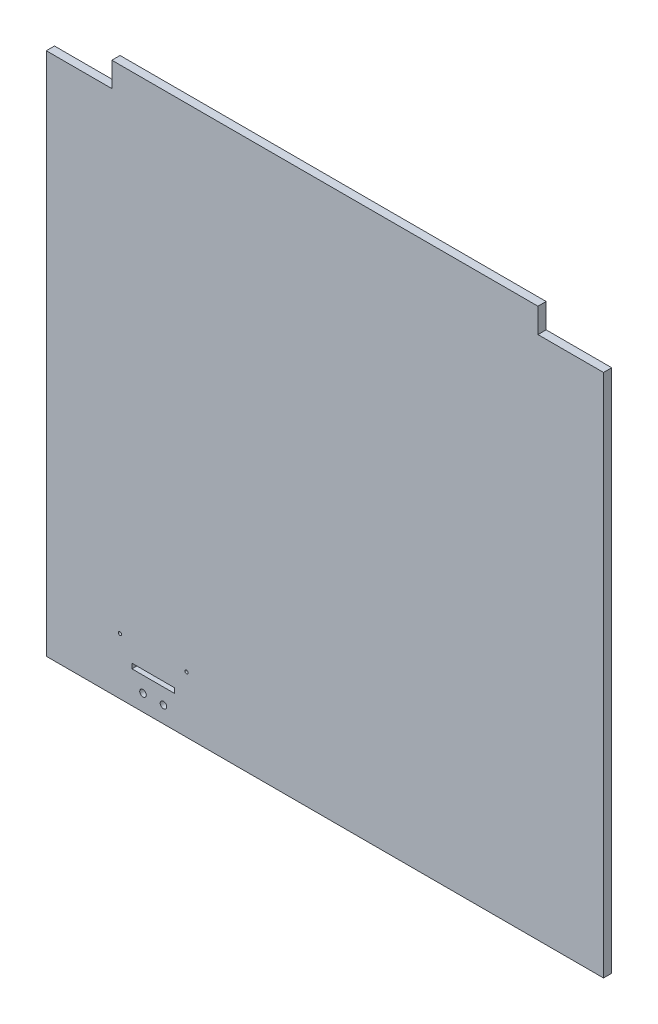
ISO-10303-21;
HEADER;
FILE_DESCRIPTION(('STEP AP214'),'2;1');
FILE_NAME('part.step','',(''),(''),'','','');
FILE_SCHEMA(('AUTOMOTIVE_DESIGN { 1 0 10303 214 1 1 1 1 }'));
ENDSEC;
DATA;
#1=APPLICATION_CONTEXT('core data for automotive mechanical design processes');
#2=APPLICATION_PROTOCOL_DEFINITION('international standard','automotive_design',2000,#1);
#3=PRODUCT_CONTEXT('',#1,'mechanical');
#4=PRODUCT('Part','Part','',(#3));
#5=PRODUCT_RELATED_PRODUCT_CATEGORY('part','',(#4));
#6=PRODUCT_DEFINITION_FORMATION('','',#4);
#7=PRODUCT_DEFINITION_CONTEXT('part definition',#1,'design');
#8=PRODUCT_DEFINITION('design','',#6,#7);
#9=PRODUCT_DEFINITION_SHAPE('','',#8);
#10=(LENGTH_UNIT() NAMED_UNIT(*) SI_UNIT(.MILLI.,.METRE.));
#11=(NAMED_UNIT(*) PLANE_ANGLE_UNIT() SI_UNIT($,.RADIAN.));
#12=(NAMED_UNIT(*) SI_UNIT($,.STERADIAN.) SOLID_ANGLE_UNIT());
#13=UNCERTAINTY_MEASURE_WITH_UNIT(LENGTH_MEASURE(1.E-05),#10,'distance_accuracy_value','');
#14=(GEOMETRIC_REPRESENTATION_CONTEXT(3) GLOBAL_UNCERTAINTY_ASSIGNED_CONTEXT((#13)) GLOBAL_UNIT_ASSIGNED_CONTEXT((#10,
#11,#12)) REPRESENTATION_CONTEXT('',''));
#15=CARTESIAN_POINT('',(0.,0.,0.));
#16=DIRECTION('',(0.,0.,1.));
#17=DIRECTION('',(1.,0.,0.));
#18=AXIS2_PLACEMENT_3D('',#15,#16,#17);
#19=CARTESIAN_POINT('',(-340.,335.,10.));
#20=DIRECTION('',(1.,0.,0.));
#21=DIRECTION('',(0.,1.,0.));
#22=AXIS2_PLACEMENT_3D('',#19,#20,#21);
#23=PLANE('',#22);
#24=DIRECTION('',(0.,-1.,0.));
#25=VECTOR('',#24,1.);
#26=CARTESIAN_POINT('',(-340.,335.,10.));
#27=LINE('',#26,#25);
#28=CARTESIAN_POINT('',(-340.,305.,10.));
#29=VERTEX_POINT('',#28);
#30=CARTESIAN_POINT('',(-340.,-335.,10.));
#31=VERTEX_POINT('',#30);
#32=EDGE_CURVE('E198',#29,#31,#27,.T.);
#33=ORIENTED_EDGE('',*,*,#32,.F.);
#34=DIRECTION('',(0.,0.,1.));
#35=VECTOR('',#34,1.);
#36=CARTESIAN_POINT('',(-340.,305.,0.));
#37=LINE('',#36,#35);
#38=CARTESIAN_POINT('',(-340.,305.,0.));
#39=VERTEX_POINT('',#38);
#40=EDGE_CURVE('E186',#39,#29,#37,.T.);
#41=ORIENTED_EDGE('',*,*,#40,.F.);
#42=DIRECTION('',(0.,-1.,0.));
#43=VECTOR('',#42,1.);
#44=CARTESIAN_POINT('',(-340.,335.,0.));
#45=LINE('',#44,#43);
#46=CARTESIAN_POINT('',(-340.,-335.,0.));
#47=VERTEX_POINT('',#46);
#48=EDGE_CURVE('E194',#39,#47,#45,.T.);
#49=ORIENTED_EDGE('',*,*,#48,.T.);
#50=DIRECTION('',(0.,0.,-1.));
#51=VECTOR('',#50,1.);
#52=CARTESIAN_POINT('',(-340.,-335.,10.));
#53=LINE('',#52,#51);
#54=EDGE_CURVE('E11',#31,#47,#53,.T.);
#55=ORIENTED_EDGE('',*,*,#54,.F.);
#56=EDGE_LOOP('',(#33,#41,#49,#55));
#57=FACE_BOUND('',#56,.T.);
#58=ADVANCED_FACE('F32',(#57),#23,.F.);
#59=CARTESIAN_POINT('',(-340.,-335.,10.));
#60=DIRECTION('',(0.,1.,0.));
#61=DIRECTION('',(0.,0.,1.));
#62=AXIS2_PLACEMENT_3D('',#59,#60,#61);
#63=PLANE('',#62);
#64=DIRECTION('',(1.,0.,0.));
#65=VECTOR('',#64,1.);
#66=CARTESIAN_POINT('',(-340.,-335.,0.));
#67=LINE('',#66,#65);
#68=CARTESIAN_POINT('',(340.,-335.,0.));
#69=VERTEX_POINT('',#68);
#70=EDGE_CURVE('E209',#47,#69,#67,.T.);
#71=ORIENTED_EDGE('',*,*,#70,.T.);
#72=DIRECTION('',(0.,0.,-1.));
#73=VECTOR('',#72,1.);
#74=CARTESIAN_POINT('',(340.,-335.,10.));
#75=LINE('',#74,#73);
#76=CARTESIAN_POINT('',(340.,-335.,10.));
#77=VERTEX_POINT('',#76);
#78=EDGE_CURVE('E39',#77,#69,#75,.T.);
#79=ORIENTED_EDGE('',*,*,#78,.F.);
#80=DIRECTION('',(1.,0.,0.));
#81=VECTOR('',#80,1.);
#82=CARTESIAN_POINT('',(-340.,-335.,10.));
#83=LINE('',#82,#81);
#84=EDGE_CURVE('E200',#31,#77,#83,.T.);
#85=ORIENTED_EDGE('',*,*,#84,.F.);
#86=ORIENTED_EDGE('',*,*,#54,.T.);
#87=EDGE_LOOP('',(#71,#79,#85,#86));
#88=FACE_BOUND('',#87,.T.);
#89=ADVANCED_FACE('F239',(#88),#63,.F.);
#90=CARTESIAN_POINT('',(340.,335.,10.));
#91=DIRECTION('',(-1.,0.,0.));
#92=DIRECTION('',(0.,-1.,0.));
#93=AXIS2_PLACEMENT_3D('',#90,#91,#92);
#94=PLANE('',#93);
#95=DIRECTION('',(0.,1.,0.));
#96=VECTOR('',#95,1.);
#97=CARTESIAN_POINT('',(340.,335.,0.));
#98=LINE('',#97,#96);
#99=CARTESIAN_POINT('',(340.,305.,0.));
#100=VERTEX_POINT('',#99);
#101=EDGE_CURVE('E211',#69,#100,#98,.T.);
#102=ORIENTED_EDGE('',*,*,#101,.T.);
#103=DIRECTION('',(0.,0.,1.));
#104=VECTOR('',#103,1.);
#105=CARTESIAN_POINT('',(340.,305.,0.));
#106=LINE('',#105,#104);
#107=CARTESIAN_POINT('',(340.,305.,10.));
#108=VERTEX_POINT('',#107);
#109=EDGE_CURVE('E172',#100,#108,#106,.T.);
#110=ORIENTED_EDGE('',*,*,#109,.T.);
#111=DIRECTION('',(0.,1.,0.));
#112=VECTOR('',#111,1.);
#113=CARTESIAN_POINT('',(340.,335.,10.));
#114=LINE('',#113,#112);
#115=EDGE_CURVE('E203',#77,#108,#114,.T.);
#116=ORIENTED_EDGE('',*,*,#115,.F.);
#117=ORIENTED_EDGE('',*,*,#78,.T.);
#118=EDGE_LOOP('',(#102,#110,#116,#117));
#119=FACE_BOUND('',#118,.T.);
#120=ADVANCED_FACE('F219',(#119),#94,.F.);
#121=CARTESIAN_POINT('',(-340.,335.,10.));
#122=DIRECTION('',(0.,-1.,0.));
#123=DIRECTION('',(1.,0.,0.));
#124=AXIS2_PLACEMENT_3D('',#121,#122,#123);
#125=PLANE('',#124);
#126=DIRECTION('',(-1.,0.,0.));
#127=VECTOR('',#126,1.);
#128=CARTESIAN_POINT('',(-340.,335.,10.));
#129=LINE('',#128,#127);
#130=CARTESIAN_POINT('',(260.,335.,10.));
#131=VERTEX_POINT('',#130);
#132=CARTESIAN_POINT('',(-260.,335.,10.));
#133=VERTEX_POINT('',#132);
#134=EDGE_CURVE('E206',#131,#133,#129,.T.);
#135=ORIENTED_EDGE('',*,*,#134,.F.);
#136=DIRECTION('',(0.,0.,1.));
#137=VECTOR('',#136,1.);
#138=CARTESIAN_POINT('',(260.,335.,0.));
#139=LINE('',#138,#137);
#140=CARTESIAN_POINT('',(260.,335.,0.));
#141=VERTEX_POINT('',#140);
#142=EDGE_CURVE('E168',#141,#131,#139,.T.);
#143=ORIENTED_EDGE('',*,*,#142,.F.);
#144=DIRECTION('',(-1.,0.,0.));
#145=VECTOR('',#144,1.);
#146=CARTESIAN_POINT('',(-340.,335.,0.));
#147=LINE('',#146,#145);
#148=CARTESIAN_POINT('',(-260.,335.,0.));
#149=VERTEX_POINT('',#148);
#150=EDGE_CURVE('E201',#141,#149,#147,.T.);
#151=ORIENTED_EDGE('',*,*,#150,.T.);
#152=DIRECTION('',(0.,0.,1.));
#153=VECTOR('',#152,1.);
#154=CARTESIAN_POINT('',(-260.,335.,0.));
#155=LINE('',#154,#153);
#156=EDGE_CURVE('E191',#149,#133,#155,.T.);
#157=ORIENTED_EDGE('',*,*,#156,.T.);
#158=EDGE_LOOP('',(#135,#143,#151,#157));
#159=FACE_BOUND('',#158,.T.);
#160=ADVANCED_FACE('F250',(#159),#125,.F.);
#161=CARTESIAN_POINT('',(0.,0.,10.));
#162=DIRECTION('',(0.,0.,1.));
#163=DIRECTION('',(1.,0.,0.));
#164=AXIS2_PLACEMENT_3D('',#161,#162,#163);
#165=PLANE('',#164);
#166=CARTESIAN_POINT('',(-169.,-266.,10.));
#167=DIRECTION('',(0.,0.,1.));
#168=DIRECTION('',(1.,0.,0.));
#169=AXIS2_PLACEMENT_3D('',#166,#167,#168);
#170=CIRCLE('',#169,2.);
#171=CARTESIAN_POINT('',(-167.,-266.,10.));
#172=VERTEX_POINT('',#171);
#173=EDGE_CURVE('E408',#172,#172,#170,.T.);
#174=ORIENTED_EDGE('',*,*,#173,.F.);
#175=EDGE_LOOP('',(#174));
#176=FACE_BOUND('',#175,.T.);
#177=CARTESIAN_POINT('',(-250.,-266.,10.));
#178=DIRECTION('',(0.,0.,1.));
#179=DIRECTION('',(1.,0.,0.));
#180=AXIS2_PLACEMENT_3D('',#177,#178,#179);
#181=CIRCLE('',#180,2.);
#182=CARTESIAN_POINT('',(-248.,-266.,10.));
#183=VERTEX_POINT('',#182);
#184=EDGE_CURVE('E410',#183,#183,#181,.T.);
#185=ORIENTED_EDGE('',*,*,#184,.F.);
#186=EDGE_LOOP('',(#185));
#187=FACE_BOUND('',#186,.T.);
#188=CARTESIAN_POINT('',(-197.,-315.,10.));
#189=DIRECTION('',(0.,0.,1.));
#190=DIRECTION('',(1.,0.,0.));
#191=AXIS2_PLACEMENT_3D('',#188,#189,#190);
#192=CIRCLE('',#191,3.99999999999999);
#193=CARTESIAN_POINT('',(-193.,-315.,10.));
#194=VERTEX_POINT('',#193);
#195=EDGE_CURVE('E416',#194,#194,#192,.T.);
#196=ORIENTED_EDGE('',*,*,#195,.F.);
#197=EDGE_LOOP('',(#196));
#198=FACE_BOUND('',#197,.T.);
#199=CARTESIAN_POINT('',(-222.,-315.,10.));
#200=DIRECTION('',(0.,0.,1.));
#201=DIRECTION('',(1.,0.,0.));
#202=AXIS2_PLACEMENT_3D('',#199,#200,#201);
#203=CIRCLE('',#202,3.99999999999999);
#204=CARTESIAN_POINT('',(-218.,-315.,10.));
#205=VERTEX_POINT('',#204);
#206=EDGE_CURVE('E144',#205,#205,#203,.T.);
#207=ORIENTED_EDGE('',*,*,#206,.F.);
#208=EDGE_LOOP('',(#207));
#209=FACE_BOUND('',#208,.T.);
#210=DIRECTION('',(0.,-1.,0.));
#211=VECTOR('',#210,1.);
#212=CARTESIAN_POINT('',(-235.5,-290.,10.));
#213=LINE('',#212,#211);
#214=CARTESIAN_POINT('',(-235.5,-290.,10.));
#215=VERTEX_POINT('',#214);
#216=CARTESIAN_POINT('',(-235.5,-296.,10.));
#217=VERTEX_POINT('',#216);
#218=EDGE_CURVE('E46',#215,#217,#213,.T.);
#219=ORIENTED_EDGE('',*,*,#218,.F.);
#220=DIRECTION('',(-1.,0.,0.));
#221=VECTOR('',#220,1.);
#222=CARTESIAN_POINT('',(-235.5,-290.,10.));
#223=LINE('',#222,#221);
#224=CARTESIAN_POINT('',(-183.5,-290.,10.));
#225=VERTEX_POINT('',#224);
#226=EDGE_CURVE('E138',#225,#215,#223,.T.);
#227=ORIENTED_EDGE('',*,*,#226,.F.);
#228=DIRECTION('',(0.,1.,0.));
#229=VECTOR('',#228,1.);
#230=CARTESIAN_POINT('',(-183.5,-290.,10.));
#231=LINE('',#230,#229);
#232=CARTESIAN_POINT('',(-183.5,-296.,10.));
#233=VERTEX_POINT('',#232);
#234=EDGE_CURVE('E141',#233,#225,#231,.T.);
#235=ORIENTED_EDGE('',*,*,#234,.F.);
#236=DIRECTION('',(1.,0.,0.));
#237=VECTOR('',#236,1.);
#238=CARTESIAN_POINT('',(-235.5,-296.,10.));
#239=LINE('',#238,#237);
#240=EDGE_CURVE('E150',#217,#233,#239,.T.);
#241=ORIENTED_EDGE('',*,*,#240,.F.);
#242=EDGE_LOOP('',(#219,#227,#235,#241));
#243=FACE_BOUND('',#242,.T.);
#244=DIRECTION('',(1.,0.,0.));
#245=VECTOR('',#244,1.);
#246=CARTESIAN_POINT('',(340.,305.,10.));
#247=LINE('',#246,#245);
#248=CARTESIAN_POINT('',(260.,305.,10.));
#249=VERTEX_POINT('',#248);
#250=EDGE_CURVE('E165',#249,#108,#247,.T.);
#251=ORIENTED_EDGE('',*,*,#250,.F.);
#252=DIRECTION('',(0.,-1.,0.));
#253=VECTOR('',#252,1.);
#254=CARTESIAN_POINT('',(260.,335.,10.));
#255=LINE('',#254,#253);
#256=EDGE_CURVE('E157',#131,#249,#255,.T.);
#257=ORIENTED_EDGE('',*,*,#256,.F.);
#258=ORIENTED_EDGE('',*,*,#134,.T.);
#259=DIRECTION('',(0.,1.,0.));
#260=VECTOR('',#259,1.);
#261=CARTESIAN_POINT('',(-260.,335.,10.));
#262=LINE('',#261,#260);
#263=CARTESIAN_POINT('',(-260.,305.,10.));
#264=VERTEX_POINT('',#263);
#265=EDGE_CURVE('E183',#264,#133,#262,.T.);
#266=ORIENTED_EDGE('',*,*,#265,.F.);
#267=DIRECTION('',(1.,0.,0.));
#268=VECTOR('',#267,1.);
#269=CARTESIAN_POINT('',(-340.,305.,10.));
#270=LINE('',#269,#268);
#271=EDGE_CURVE('E175',#29,#264,#270,.T.);
#272=ORIENTED_EDGE('',*,*,#271,.F.);
#273=ORIENTED_EDGE('',*,*,#32,.T.);
#274=ORIENTED_EDGE('',*,*,#84,.T.);
#275=ORIENTED_EDGE('',*,*,#115,.T.);
#276=EDGE_LOOP('',(#251,#257,#258,#266,#272,#273,#274,#275));
#277=FACE_BOUND('',#276,.T.);
#278=ADVANCED_FACE('F235',(#176,#187,#198,#209,#243,#277),#165,.T.);
#279=CARTESIAN_POINT('',(0.,0.,0.));
#280=DIRECTION('',(0.,0.,1.));
#281=DIRECTION('',(1.,0.,0.));
#282=AXIS2_PLACEMENT_3D('',#279,#280,#281);
#283=PLANE('',#282);
#284=CARTESIAN_POINT('',(-169.,-266.,0.));
#285=DIRECTION('',(0.,0.,1.));
#286=DIRECTION('',(1.,0.,0.));
#287=AXIS2_PLACEMENT_3D('',#284,#285,#286);
#288=CIRCLE('',#287,2.);
#289=CARTESIAN_POINT('',(-167.,-266.,0.));
#290=VERTEX_POINT('',#289);
#291=EDGE_CURVE('E405',#290,#290,#288,.T.);
#292=ORIENTED_EDGE('',*,*,#291,.T.);
#293=EDGE_LOOP('',(#292));
#294=FACE_BOUND('',#293,.T.);
#295=CARTESIAN_POINT('',(-250.,-266.,0.));
#296=DIRECTION('',(0.,0.,1.));
#297=DIRECTION('',(1.,0.,0.));
#298=AXIS2_PLACEMENT_3D('',#295,#296,#297);
#299=CIRCLE('',#298,2.);
#300=CARTESIAN_POINT('',(-248.,-266.,0.));
#301=VERTEX_POINT('',#300);
#302=EDGE_CURVE('E413',#301,#301,#299,.T.);
#303=ORIENTED_EDGE('',*,*,#302,.T.);
#304=EDGE_LOOP('',(#303));
#305=FACE_BOUND('',#304,.T.);
#306=CARTESIAN_POINT('',(-197.,-315.,0.));
#307=DIRECTION('',(0.,0.,1.));
#308=DIRECTION('',(1.,0.,0.));
#309=AXIS2_PLACEMENT_3D('',#306,#307,#308);
#310=CIRCLE('',#309,3.99999999999999);
#311=CARTESIAN_POINT('',(-193.,-315.,0.));
#312=VERTEX_POINT('',#311);
#313=EDGE_CURVE('E419',#312,#312,#310,.T.);
#314=ORIENTED_EDGE('',*,*,#313,.T.);
#315=EDGE_LOOP('',(#314));
#316=FACE_BOUND('',#315,.T.);
#317=CARTESIAN_POINT('',(-222.,-315.,0.));
#318=DIRECTION('',(0.,0.,1.));
#319=DIRECTION('',(1.,0.,0.));
#320=AXIS2_PLACEMENT_3D('',#317,#318,#319);
#321=CIRCLE('',#320,3.99999999999999);
#322=CARTESIAN_POINT('',(-218.,-315.,0.));
#323=VERTEX_POINT('',#322);
#324=EDGE_CURVE('E151',#323,#323,#321,.T.);
#325=ORIENTED_EDGE('',*,*,#324,.T.);
#326=EDGE_LOOP('',(#325));
#327=FACE_BOUND('',#326,.T.);
#328=DIRECTION('',(-1.,0.,0.));
#329=VECTOR('',#328,1.);
#330=CARTESIAN_POINT('',(-235.5,-290.,0.));
#331=LINE('',#330,#329);
#332=CARTESIAN_POINT('',(-183.5,-290.,0.));
#333=VERTEX_POINT('',#332);
#334=CARTESIAN_POINT('',(-235.5,-290.,0.));
#335=VERTEX_POINT('',#334);
#336=EDGE_CURVE('E128',#333,#335,#331,.T.);
#337=ORIENTED_EDGE('',*,*,#336,.T.);
#338=DIRECTION('',(0.,-1.,0.));
#339=VECTOR('',#338,1.);
#340=CARTESIAN_POINT('',(-235.5,-290.,0.));
#341=LINE('',#340,#339);
#342=CARTESIAN_POINT('',(-235.5,-296.,0.));
#343=VERTEX_POINT('',#342);
#344=EDGE_CURVE('E122',#335,#343,#341,.T.);
#345=ORIENTED_EDGE('',*,*,#344,.T.);
#346=DIRECTION('',(1.,0.,0.));
#347=VECTOR('',#346,1.);
#348=CARTESIAN_POINT('',(-235.5,-296.,0.));
#349=LINE('',#348,#347);
#350=CARTESIAN_POINT('',(-183.5,-296.,0.));
#351=VERTEX_POINT('',#350);
#352=EDGE_CURVE('E131',#343,#351,#349,.T.);
#353=ORIENTED_EDGE('',*,*,#352,.T.);
#354=DIRECTION('',(0.,1.,0.));
#355=VECTOR('',#354,1.);
#356=CARTESIAN_POINT('',(-183.5,-290.,0.));
#357=LINE('',#356,#355);
#358=EDGE_CURVE('E54',#351,#333,#357,.T.);
#359=ORIENTED_EDGE('',*,*,#358,.T.);
#360=EDGE_LOOP('',(#337,#345,#353,#359));
#361=FACE_BOUND('',#360,.T.);
#362=DIRECTION('',(0.,-1.,0.));
#363=VECTOR('',#362,1.);
#364=CARTESIAN_POINT('',(260.,335.,0.));
#365=LINE('',#364,#363);
#366=CARTESIAN_POINT('',(260.,305.,0.));
#367=VERTEX_POINT('',#366);
#368=EDGE_CURVE('E161',#141,#367,#365,.T.);
#369=ORIENTED_EDGE('',*,*,#368,.T.);
#370=DIRECTION('',(1.,0.,0.));
#371=VECTOR('',#370,1.);
#372=CARTESIAN_POINT('',(340.,305.,0.));
#373=LINE('',#372,#371);
#374=EDGE_CURVE('E164',#367,#100,#373,.T.);
#375=ORIENTED_EDGE('',*,*,#374,.T.);
#376=ORIENTED_EDGE('',*,*,#101,.F.);
#377=ORIENTED_EDGE('',*,*,#70,.F.);
#378=ORIENTED_EDGE('',*,*,#48,.F.);
#379=DIRECTION('',(1.,0.,0.));
#380=VECTOR('',#379,1.);
#381=CARTESIAN_POINT('',(-340.,305.,0.));
#382=LINE('',#381,#380);
#383=CARTESIAN_POINT('',(-260.,305.,0.));
#384=VERTEX_POINT('',#383);
#385=EDGE_CURVE('E179',#39,#384,#382,.T.);
#386=ORIENTED_EDGE('',*,*,#385,.T.);
#387=DIRECTION('',(0.,1.,0.));
#388=VECTOR('',#387,1.);
#389=CARTESIAN_POINT('',(-260.,335.,0.));
#390=LINE('',#389,#388);
#391=EDGE_CURVE('E182',#384,#149,#390,.T.);
#392=ORIENTED_EDGE('',*,*,#391,.T.);
#393=ORIENTED_EDGE('',*,*,#150,.F.);
#394=EDGE_LOOP('',(#369,#375,#376,#377,#378,#386,#392,#393));
#395=FACE_BOUND('',#394,.T.);
#396=ADVANCED_FACE('F135',(#294,#305,#316,#327,#361,#395),#283,.F.);
#397=CARTESIAN_POINT('',(-260.,335.,0.));
#398=DIRECTION('',(1.,0.,0.));
#399=DIRECTION('',(0.,0.,-1.));
#400=AXIS2_PLACEMENT_3D('',#397,#398,#399);
#401=PLANE('',#400);
#402=ORIENTED_EDGE('',*,*,#265,.T.);
#403=ORIENTED_EDGE('',*,*,#156,.F.);
#404=ORIENTED_EDGE('',*,*,#391,.F.);
#405=DIRECTION('',(0.,0.,1.));
#406=VECTOR('',#405,1.);
#407=CARTESIAN_POINT('',(-260.,305.,0.));
#408=LINE('',#407,#406);
#409=EDGE_CURVE('E195',#384,#264,#408,.T.);
#410=ORIENTED_EDGE('',*,*,#409,.T.);
#411=EDGE_LOOP('',(#402,#403,#404,#410));
#412=FACE_BOUND('',#411,.T.);
#413=ADVANCED_FACE('F247',(#412),#401,.F.);
#414=CARTESIAN_POINT('',(-340.,305.,0.));
#415=DIRECTION('',(0.,-1.,0.));
#416=DIRECTION('',(0.,0.,-1.));
#417=AXIS2_PLACEMENT_3D('',#414,#415,#416);
#418=PLANE('',#417);
#419=ORIENTED_EDGE('',*,*,#271,.T.);
#420=ORIENTED_EDGE('',*,*,#409,.F.);
#421=ORIENTED_EDGE('',*,*,#385,.F.);
#422=ORIENTED_EDGE('',*,*,#40,.T.);
#423=EDGE_LOOP('',(#419,#420,#421,#422));
#424=FACE_BOUND('',#423,.T.);
#425=ADVANCED_FACE('F244',(#424),#418,.F.);
#426=CARTESIAN_POINT('',(340.,305.,0.));
#427=DIRECTION('',(0.,-1.,0.));
#428=DIRECTION('',(0.,0.,-1.));
#429=AXIS2_PLACEMENT_3D('',#426,#427,#428);
#430=PLANE('',#429);
#431=ORIENTED_EDGE('',*,*,#250,.T.);
#432=ORIENTED_EDGE('',*,*,#109,.F.);
#433=ORIENTED_EDGE('',*,*,#374,.F.);
#434=DIRECTION('',(0.,0.,1.));
#435=VECTOR('',#434,1.);
#436=CARTESIAN_POINT('',(260.,305.,0.));
#437=LINE('',#436,#435);
#438=EDGE_CURVE('E176',#367,#249,#437,.T.);
#439=ORIENTED_EDGE('',*,*,#438,.T.);
#440=EDGE_LOOP('',(#431,#432,#433,#439));
#441=FACE_BOUND('',#440,.T.);
#442=ADVANCED_FACE('F227',(#441),#430,.F.);
#443=CARTESIAN_POINT('',(260.,335.,0.));
#444=DIRECTION('',(-1.,0.,0.));
#445=DIRECTION('',(0.,-1.,0.));
#446=AXIS2_PLACEMENT_3D('',#443,#444,#445);
#447=PLANE('',#446);
#448=ORIENTED_EDGE('',*,*,#256,.T.);
#449=ORIENTED_EDGE('',*,*,#438,.F.);
#450=ORIENTED_EDGE('',*,*,#368,.F.);
#451=ORIENTED_EDGE('',*,*,#142,.T.);
#452=EDGE_LOOP('',(#448,#449,#450,#451));
#453=FACE_BOUND('',#452,.T.);
#454=ADVANCED_FACE('F229',(#453),#447,.F.);
#455=CARTESIAN_POINT('',(-235.5,-290.,0.));
#456=DIRECTION('',(-1.,0.,0.));
#457=DIRECTION('',(0.,-1.,0.));
#458=AXIS2_PLACEMENT_3D('',#455,#456,#457);
#459=PLANE('',#458);
#460=ORIENTED_EDGE('',*,*,#218,.T.);
#461=DIRECTION('',(0.,0.,1.));
#462=VECTOR('',#461,1.);
#463=CARTESIAN_POINT('',(-235.5,-296.,0.));
#464=LINE('',#463,#462);
#465=EDGE_CURVE('E118',#343,#217,#464,.T.);
#466=ORIENTED_EDGE('',*,*,#465,.F.);
#467=ORIENTED_EDGE('',*,*,#344,.F.);
#468=DIRECTION('',(0.,0.,1.));
#469=VECTOR('',#468,1.);
#470=CARTESIAN_POINT('',(-235.5,-290.,0.));
#471=LINE('',#470,#469);
#472=EDGE_CURVE('E155',#335,#215,#471,.T.);
#473=ORIENTED_EDGE('',*,*,#472,.T.);
#474=EDGE_LOOP('',(#460,#466,#467,#473));
#475=FACE_BOUND('',#474,.T.);
#476=ADVANCED_FACE('F120',(#475),#459,.F.);
#477=CARTESIAN_POINT('',(-235.5,-290.,0.));
#478=DIRECTION('',(0.,1.,0.));
#479=DIRECTION('',(-1.,0.,0.));
#480=AXIS2_PLACEMENT_3D('',#477,#478,#479);
#481=PLANE('',#480);
#482=ORIENTED_EDGE('',*,*,#226,.T.);
#483=ORIENTED_EDGE('',*,*,#472,.F.);
#484=ORIENTED_EDGE('',*,*,#336,.F.);
#485=DIRECTION('',(0.,0.,1.));
#486=VECTOR('',#485,1.);
#487=CARTESIAN_POINT('',(-183.5,-290.,0.));
#488=LINE('',#487,#486);
#489=EDGE_CURVE('E158',#333,#225,#488,.T.);
#490=ORIENTED_EDGE('',*,*,#489,.T.);
#491=EDGE_LOOP('',(#482,#483,#484,#490));
#492=FACE_BOUND('',#491,.T.);
#493=ADVANCED_FACE('F325',(#492),#481,.F.);
#494=CARTESIAN_POINT('',(-183.5,-290.,0.));
#495=DIRECTION('',(1.,0.,0.));
#496=DIRECTION('',(0.,0.,-1.));
#497=AXIS2_PLACEMENT_3D('',#494,#495,#496);
#498=PLANE('',#497);
#499=ORIENTED_EDGE('',*,*,#234,.T.);
#500=ORIENTED_EDGE('',*,*,#489,.F.);
#501=ORIENTED_EDGE('',*,*,#358,.F.);
#502=DIRECTION('',(0.,0.,1.));
#503=VECTOR('',#502,1.);
#504=CARTESIAN_POINT('',(-183.5,-296.,0.));
#505=LINE('',#504,#503);
#506=EDGE_CURVE('E127',#351,#233,#505,.T.);
#507=ORIENTED_EDGE('',*,*,#506,.T.);
#508=EDGE_LOOP('',(#499,#500,#501,#507));
#509=FACE_BOUND('',#508,.T.);
#510=ADVANCED_FACE('F332',(#509),#498,.F.);
#511=CARTESIAN_POINT('',(-235.5,-296.,0.));
#512=DIRECTION('',(0.,-1.,0.));
#513=DIRECTION('',(0.,0.,-1.));
#514=AXIS2_PLACEMENT_3D('',#511,#512,#513);
#515=PLANE('',#514);
#516=ORIENTED_EDGE('',*,*,#240,.T.);
#517=ORIENTED_EDGE('',*,*,#506,.F.);
#518=ORIENTED_EDGE('',*,*,#352,.F.);
#519=ORIENTED_EDGE('',*,*,#465,.T.);
#520=EDGE_LOOP('',(#516,#517,#518,#519));
#521=FACE_BOUND('',#520,.T.);
#522=ADVANCED_FACE('F132',(#521),#515,.F.);
#523=CARTESIAN_POINT('',(-222.,-315.,0.));
#524=DIRECTION('',(0.,0.,1.));
#525=DIRECTION('',(1.,0.,0.));
#526=AXIS2_PLACEMENT_3D('',#523,#524,#525);
#527=CYLINDRICAL_SURFACE('',#526,3.99999999999999);
#528=ORIENTED_EDGE('',*,*,#324,.F.);
#529=EDGE_LOOP('',(#528));
#530=FACE_BOUND('',#529,.T.);
#531=ORIENTED_EDGE('',*,*,#206,.T.);
#532=EDGE_LOOP('',(#531));
#533=FACE_BOUND('',#532,.T.);
#534=ADVANCED_FACE('F346',(#530,#533),#527,.F.);
#535=CARTESIAN_POINT('',(-197.,-315.,0.));
#536=DIRECTION('',(0.,0.,1.));
#537=DIRECTION('',(1.,0.,0.));
#538=AXIS2_PLACEMENT_3D('',#535,#536,#537);
#539=CYLINDRICAL_SURFACE('',#538,3.99999999999999);
#540=ORIENTED_EDGE('',*,*,#313,.F.);
#541=EDGE_LOOP('',(#540));
#542=FACE_BOUND('',#541,.T.);
#543=ORIENTED_EDGE('',*,*,#195,.T.);
#544=EDGE_LOOP('',(#543));
#545=FACE_BOUND('',#544,.T.);
#546=ADVANCED_FACE('F353',(#542,#545),#539,.F.);
#547=CARTESIAN_POINT('',(-250.,-266.,0.));
#548=DIRECTION('',(0.,0.,1.));
#549=DIRECTION('',(1.,0.,0.));
#550=AXIS2_PLACEMENT_3D('',#547,#548,#549);
#551=CYLINDRICAL_SURFACE('',#550,2.);
#552=ORIENTED_EDGE('',*,*,#302,.F.);
#553=EDGE_LOOP('',(#552));
#554=FACE_BOUND('',#553,.T.);
#555=ORIENTED_EDGE('',*,*,#184,.T.);
#556=EDGE_LOOP('',(#555));
#557=FACE_BOUND('',#556,.T.);
#558=ADVANCED_FACE('F360',(#554,#557),#551,.F.);
#559=CARTESIAN_POINT('',(-169.,-266.,0.));
#560=DIRECTION('',(0.,0.,1.));
#561=DIRECTION('',(1.,0.,0.));
#562=AXIS2_PLACEMENT_3D('',#559,#560,#561);
#563=CYLINDRICAL_SURFACE('',#562,2.);
#564=ORIENTED_EDGE('',*,*,#291,.F.);
#565=EDGE_LOOP('',(#564));
#566=FACE_BOUND('',#565,.T.);
#567=ORIENTED_EDGE('',*,*,#173,.T.);
#568=EDGE_LOOP('',(#567));
#569=FACE_BOUND('',#568,.T.);
#570=ADVANCED_FACE('F367',(#566,#569),#563,.F.);
#571=CLOSED_SHELL('',(#58,#89,#120,#160,#278,#396,#413,#425,#442,#454,#476,#493,#510,#522,#534,
#546,#558,#570));
#572=MANIFOLD_SOLID_BREP('B2',#571);
#573=ADVANCED_BREP_SHAPE_REPRESENTATION('',(#18,#572),#14);
#574=SHAPE_DEFINITION_REPRESENTATION(#9,#573);
ENDSEC;
END-ISO-10303-21;
